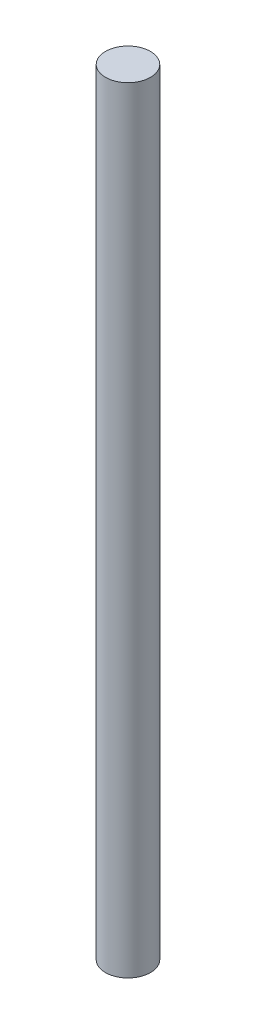
ISO-10303-21;
HEADER;
FILE_DESCRIPTION(('STEP AP214'),'2;1');
FILE_NAME('part.step','',(''),(''),'','','');
FILE_SCHEMA(('AUTOMOTIVE_DESIGN { 1 0 10303 214 1 1 1 1 }'));
ENDSEC;
DATA;
#1=APPLICATION_CONTEXT('core data for automotive mechanical design processes');
#2=APPLICATION_PROTOCOL_DEFINITION('international standard','automotive_design',2000,#1);
#3=PRODUCT_CONTEXT('',#1,'mechanical');
#4=PRODUCT('Part','Part','',(#3));
#5=PRODUCT_RELATED_PRODUCT_CATEGORY('part','',(#4));
#6=PRODUCT_DEFINITION_FORMATION('','',#4);
#7=PRODUCT_DEFINITION_CONTEXT('part definition',#1,'design');
#8=PRODUCT_DEFINITION('design','',#6,#7);
#9=PRODUCT_DEFINITION_SHAPE('','',#8);
#10=(LENGTH_UNIT() NAMED_UNIT(*) SI_UNIT(.MILLI.,.METRE.));
#11=(NAMED_UNIT(*) PLANE_ANGLE_UNIT() SI_UNIT($,.RADIAN.));
#12=(NAMED_UNIT(*) SI_UNIT($,.STERADIAN.) SOLID_ANGLE_UNIT());
#13=UNCERTAINTY_MEASURE_WITH_UNIT(LENGTH_MEASURE(1.E-05),#10,'distance_accuracy_value','');
#14=(GEOMETRIC_REPRESENTATION_CONTEXT(3) GLOBAL_UNCERTAINTY_ASSIGNED_CONTEXT((#13)) GLOBAL_UNIT_ASSIGNED_CONTEXT((#10,
#11,#12)) REPRESENTATION_CONTEXT('',''));
#15=CARTESIAN_POINT('',(0.,0.,0.));
#16=DIRECTION('',(0.,0.,1.));
#17=DIRECTION('',(1.,0.,0.));
#18=AXIS2_PLACEMENT_3D('',#15,#16,#17);
#19=CARTESIAN_POINT('',(0.,50.,0.));
#20=DIRECTION('',(0.,-1.,0.));
#21=DIRECTION('',(0.,0.,-1.));
#22=AXIS2_PLACEMENT_3D('',#19,#20,#21);
#23=CYLINDRICAL_SURFACE('',#22,1.45);
#24=CARTESIAN_POINT('',(0.,50.,0.));
#25=DIRECTION('',(0.,1.,0.));
#26=DIRECTION('',(0.,0.,1.));
#27=AXIS2_PLACEMENT_3D('',#24,#25,#26);
#28=CIRCLE('',#27,1.45);
#29=CARTESIAN_POINT('',(0.,50.,1.45));
#30=VERTEX_POINT('',#29);
#31=EDGE_CURVE('E10',#30,#30,#28,.T.);
#32=ORIENTED_EDGE('',*,*,#31,.F.);
#33=EDGE_LOOP('',(#32));
#34=FACE_BOUND('',#33,.T.);
#35=CARTESIAN_POINT('',(0.,0.,0.));
#36=DIRECTION('',(0.,1.,0.));
#37=DIRECTION('',(0.,0.,1.));
#38=AXIS2_PLACEMENT_3D('',#35,#36,#37);
#39=CIRCLE('',#38,1.45);
#40=CARTESIAN_POINT('',(0.,0.,1.45));
#41=VERTEX_POINT('',#40);
#42=EDGE_CURVE('E37',#41,#41,#39,.T.);
#43=ORIENTED_EDGE('',*,*,#42,.T.);
#44=EDGE_LOOP('',(#43));
#45=FACE_BOUND('',#44,.T.);
#46=ADVANCED_FACE('F34',(#34,#45),#23,.T.);
#47=CARTESIAN_POINT('',(0.,50.,0.));
#48=DIRECTION('',(0.,1.,0.));
#49=DIRECTION('',(0.,0.,1.));
#50=AXIS2_PLACEMENT_3D('',#47,#48,#49);
#51=PLANE('',#50);
#52=ORIENTED_EDGE('',*,*,#31,.T.);
#53=EDGE_LOOP('',(#52));
#54=FACE_BOUND('',#53,.T.);
#55=ADVANCED_FACE('F51',(#54),#51,.T.);
#56=CARTESIAN_POINT('',(0.,0.,0.));
#57=DIRECTION('',(0.,1.,0.));
#58=DIRECTION('',(0.,0.,1.));
#59=AXIS2_PLACEMENT_3D('',#56,#57,#58);
#60=PLANE('',#59);
#61=ORIENTED_EDGE('',*,*,#42,.F.);
#62=EDGE_LOOP('',(#61));
#63=FACE_BOUND('',#62,.T.);
#64=ADVANCED_FACE('F49',(#63),#60,.F.);
#65=CLOSED_SHELL('',(#46,#55,#64));
#66=MANIFOLD_SOLID_BREP('B2',#65);
#67=ADVANCED_BREP_SHAPE_REPRESENTATION('',(#18,#66),#14);
#68=SHAPE_DEFINITION_REPRESENTATION(#9,#67);
ENDSEC;
END-ISO-10303-21;
